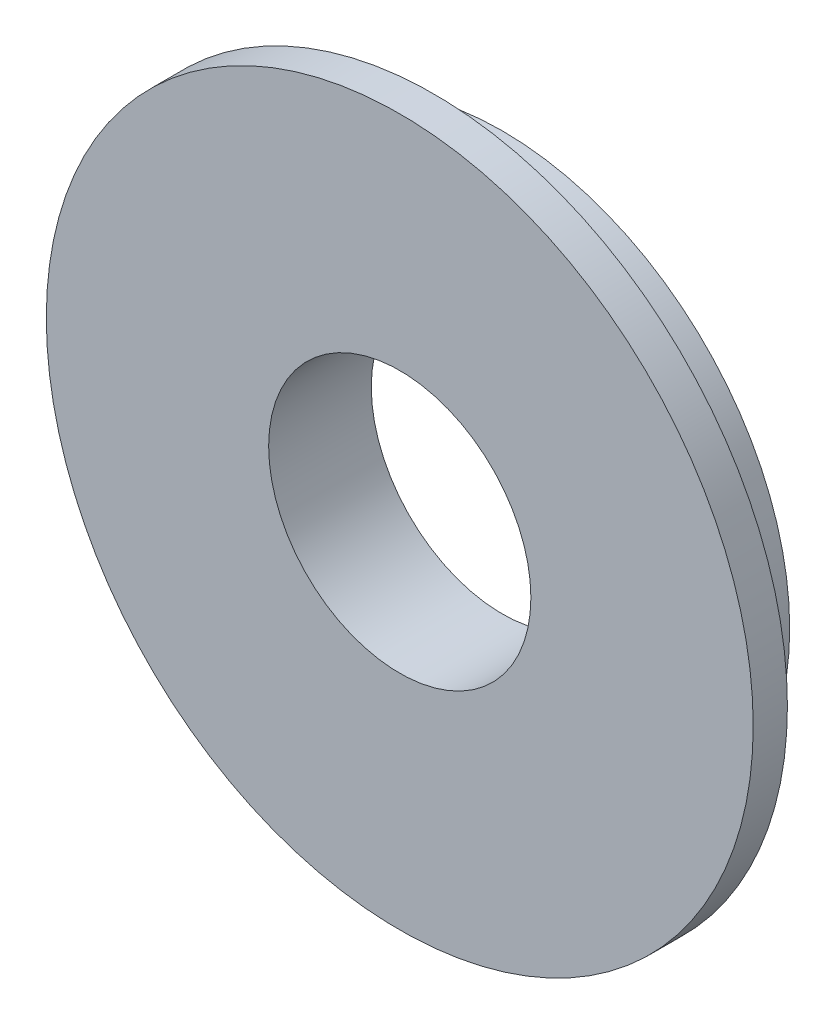
ISO-10303-21;
HEADER;
FILE_DESCRIPTION(('STEP AP214'),'2;1');
FILE_NAME('part.step','',(''),(''),'','','');
FILE_SCHEMA(('AUTOMOTIVE_DESIGN { 1 0 10303 214 1 1 1 1 }'));
ENDSEC;
DATA;
#1=APPLICATION_CONTEXT('core data for automotive mechanical design processes');
#2=APPLICATION_PROTOCOL_DEFINITION('international standard','automotive_design',2000,#1);
#3=PRODUCT_CONTEXT('',#1,'mechanical');
#4=PRODUCT('Part','Part','',(#3));
#5=PRODUCT_RELATED_PRODUCT_CATEGORY('part','',(#4));
#6=PRODUCT_DEFINITION_FORMATION('','',#4);
#7=PRODUCT_DEFINITION_CONTEXT('part definition',#1,'design');
#8=PRODUCT_DEFINITION('design','',#6,#7);
#9=PRODUCT_DEFINITION_SHAPE('','',#8);
#10=(LENGTH_UNIT() NAMED_UNIT(*) SI_UNIT(.MILLI.,.METRE.));
#11=(NAMED_UNIT(*) PLANE_ANGLE_UNIT() SI_UNIT($,.RADIAN.));
#12=(NAMED_UNIT(*) SI_UNIT($,.STERADIAN.) SOLID_ANGLE_UNIT());
#13=UNCERTAINTY_MEASURE_WITH_UNIT(LENGTH_MEASURE(1.E-05),#10,'distance_accuracy_value','');
#14=(GEOMETRIC_REPRESENTATION_CONTEXT(3) GLOBAL_UNCERTAINTY_ASSIGNED_CONTEXT((#13)) GLOBAL_UNIT_ASSIGNED_CONTEXT((#10,
#11,#12)) REPRESENTATION_CONTEXT('',''));
#15=CARTESIAN_POINT('',(0.,0.,0.));
#16=DIRECTION('',(0.,0.,1.));
#17=DIRECTION('',(1.,0.,0.));
#18=AXIS2_PLACEMENT_3D('',#15,#16,#17);
#19=CARTESIAN_POINT('',(0.,0.,1.5));
#20=DIRECTION('',(0.,0.,1.));
#21=DIRECTION('',(1.,0.,0.));
#22=AXIS2_PLACEMENT_3D('',#19,#20,#21);
#23=PLANE('',#22);
#24=CARTESIAN_POINT('',(0.,0.,1.5));
#25=DIRECTION('',(0.,0.,1.));
#26=DIRECTION('',(1.,0.,0.));
#27=AXIS2_PLACEMENT_3D('',#24,#25,#26);
#28=CIRCLE('',#27,15.5);
#29=CARTESIAN_POINT('',(15.5,0.,1.5));
#30=VERTEX_POINT('',#29);
#31=EDGE_CURVE('E42',#30,#30,#28,.T.);
#32=ORIENTED_EDGE('',*,*,#31,.T.);
#33=EDGE_LOOP('',(#32));
#34=FACE_BOUND('',#33,.T.);
#35=CARTESIAN_POINT('',(0.,0.,1.5));
#36=DIRECTION('',(0.,0.,1.));
#37=DIRECTION('',(1.,0.,0.));
#38=AXIS2_PLACEMENT_3D('',#35,#36,#37);
#39=CIRCLE('',#38,5.75);
#40=CARTESIAN_POINT('',(5.75,0.,1.5));
#41=VERTEX_POINT('',#40);
#42=EDGE_CURVE('E51',#41,#41,#39,.T.);
#43=ORIENTED_EDGE('',*,*,#42,.F.);
#44=EDGE_LOOP('',(#43));
#45=FACE_BOUND('',#44,.T.);
#46=ADVANCED_FACE('F34',(#34,#45),#23,.T.);
#47=CARTESIAN_POINT('',(0.,0.,0.));
#48=DIRECTION('',(0.,0.,1.));
#49=DIRECTION('',(1.,0.,0.));
#50=AXIS2_PLACEMENT_3D('',#47,#48,#49);
#51=PLANE('',#50);
#52=CARTESIAN_POINT('',(0.,0.,0.));
#53=DIRECTION('',(0.,0.,-1.));
#54=DIRECTION('',(-1.,0.,0.));
#55=AXIS2_PLACEMENT_3D('',#52,#53,#54);
#56=CIRCLE('',#55,12.6);
#57=CARTESIAN_POINT('',(-12.6,0.,0.));
#58=VERTEX_POINT('',#57);
#59=EDGE_CURVE('E10',#58,#58,#56,.T.);
#60=ORIENTED_EDGE('',*,*,#59,.F.);
#61=EDGE_LOOP('',(#60));
#62=FACE_BOUND('',#61,.T.);
#63=CARTESIAN_POINT('',(0.,0.,0.));
#64=DIRECTION('',(0.,0.,1.));
#65=DIRECTION('',(1.,0.,0.));
#66=AXIS2_PLACEMENT_3D('',#63,#64,#65);
#67=CIRCLE('',#66,15.5);
#68=CARTESIAN_POINT('',(15.5,0.,0.));
#69=VERTEX_POINT('',#68);
#70=EDGE_CURVE('E38',#69,#69,#67,.T.);
#71=ORIENTED_EDGE('',*,*,#70,.F.);
#72=EDGE_LOOP('',(#71));
#73=FACE_BOUND('',#72,.T.);
#74=ADVANCED_FACE('F77',(#62,#73),#51,.F.);
#75=CARTESIAN_POINT('',(0.,0.,1.5));
#76=DIRECTION('',(0.,0.,-1.));
#77=DIRECTION('',(-1.,0.,0.));
#78=AXIS2_PLACEMENT_3D('',#75,#76,#77);
#79=CYLINDRICAL_SURFACE('',#78,15.5);
#80=ORIENTED_EDGE('',*,*,#31,.F.);
#81=EDGE_LOOP('',(#80));
#82=FACE_BOUND('',#81,.T.);
#83=ORIENTED_EDGE('',*,*,#70,.T.);
#84=EDGE_LOOP('',(#83));
#85=FACE_BOUND('',#84,.T.);
#86=ADVANCED_FACE('F36',(#82,#85),#79,.T.);
#87=CARTESIAN_POINT('',(0.,0.,1.5));
#88=DIRECTION('',(0.,0.,-1.));
#89=DIRECTION('',(-1.,0.,0.));
#90=AXIS2_PLACEMENT_3D('',#87,#88,#89);
#91=CYLINDRICAL_SURFACE('',#90,5.75);
#92=ORIENTED_EDGE('',*,*,#42,.T.);
#93=EDGE_LOOP('',(#92));
#94=FACE_BOUND('',#93,.T.);
#95=CARTESIAN_POINT('',(0.,0.,-3.));
#96=DIRECTION('',(0.,0.,-1.));
#97=DIRECTION('',(-1.,0.,0.));
#98=AXIS2_PLACEMENT_3D('',#95,#96,#97);
#99=CIRCLE('',#98,5.75);
#100=CARTESIAN_POINT('',(-5.75,0.,-3.));
#101=VERTEX_POINT('',#100);
#102=EDGE_CURVE('E57',#101,#101,#99,.T.);
#103=ORIENTED_EDGE('',*,*,#102,.T.);
#104=EDGE_LOOP('',(#103));
#105=FACE_BOUND('',#104,.T.);
#106=ADVANCED_FACE('F63',(#94,#105),#91,.F.);
#107=CARTESIAN_POINT('',(0.,0.,-3.));
#108=DIRECTION('',(0.,0.,-1.));
#109=DIRECTION('',(-1.,0.,0.));
#110=AXIS2_PLACEMENT_3D('',#107,#108,#109);
#111=PLANE('',#110);
#112=CARTESIAN_POINT('',(0.,0.,-3.));
#113=DIRECTION('',(0.,0.,-1.));
#114=DIRECTION('',(-1.,0.,0.));
#115=AXIS2_PLACEMENT_3D('',#112,#113,#114);
#116=CIRCLE('',#115,12.6);
#117=CARTESIAN_POINT('',(-12.6,0.,-3.));
#118=VERTEX_POINT('',#117);
#119=EDGE_CURVE('E49',#118,#118,#116,.T.);
#120=ORIENTED_EDGE('',*,*,#119,.T.);
#121=EDGE_LOOP('',(#120));
#122=FACE_BOUND('',#121,.T.);
#123=ORIENTED_EDGE('',*,*,#102,.F.);
#124=EDGE_LOOP('',(#123));
#125=FACE_BOUND('',#124,.T.);
#126=ADVANCED_FACE('F65',(#122,#125),#111,.T.);
#127=CARTESIAN_POINT('',(0.,0.,-3.));
#128=DIRECTION('',(0.,0.,1.));
#129=DIRECTION('',(1.,0.,0.));
#130=AXIS2_PLACEMENT_3D('',#127,#128,#129);
#131=CYLINDRICAL_SURFACE('',#130,12.6);
#132=ORIENTED_EDGE('',*,*,#119,.F.);
#133=EDGE_LOOP('',(#132));
#134=FACE_BOUND('',#133,.T.);
#135=ORIENTED_EDGE('',*,*,#59,.T.);
#136=EDGE_LOOP('',(#135));
#137=FACE_BOUND('',#136,.T.);
#138=ADVANCED_FACE('F67',(#134,#137),#131,.T.);
#139=CLOSED_SHELL('',(#46,#74,#86,#106,#126,#138));
#140=MANIFOLD_SOLID_BREP('B2',#139);
#141=ADVANCED_BREP_SHAPE_REPRESENTATION('',(#18,#140),#14);
#142=SHAPE_DEFINITION_REPRESENTATION(#9,#141);
ENDSEC;
END-ISO-10303-21;
